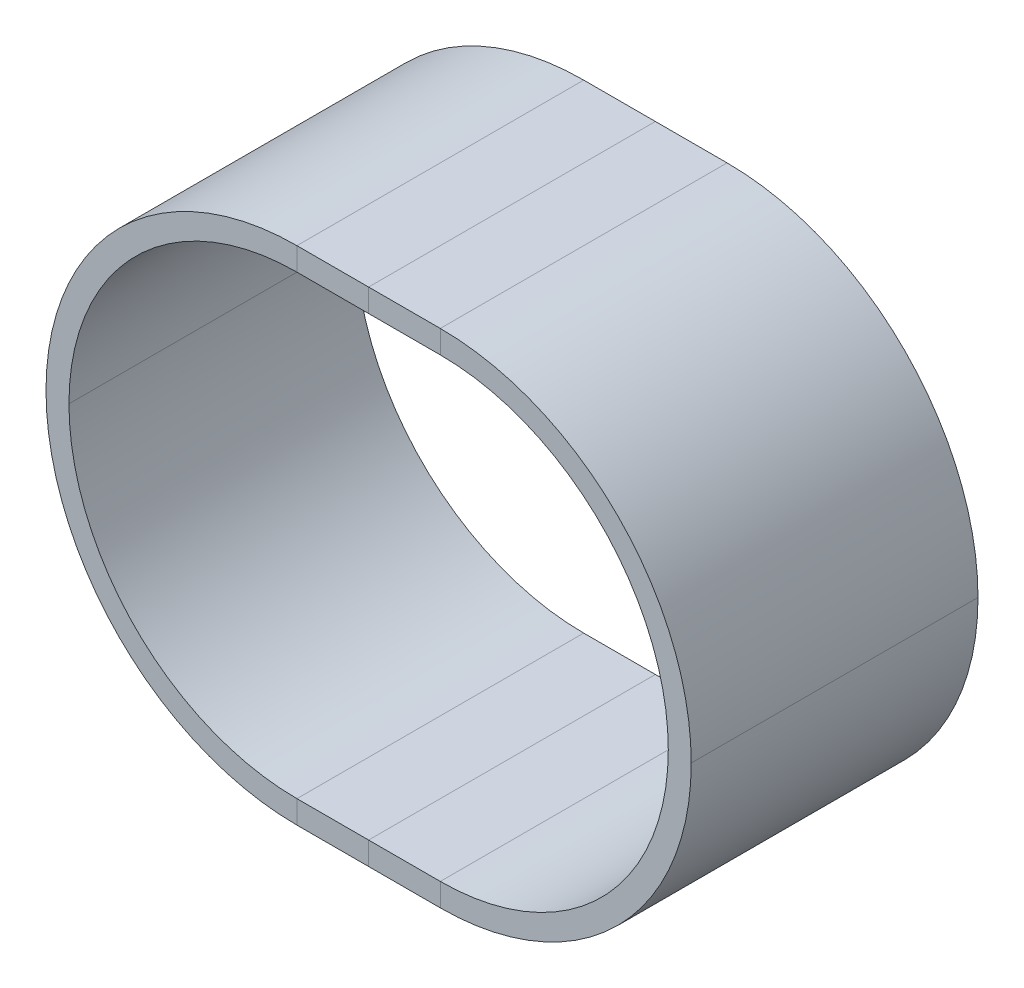
ISO-10303-21;
HEADER;
FILE_DESCRIPTION(('STEP AP214'),'2;1');
FILE_NAME('part.step','',(''),(''),'','','');
FILE_SCHEMA(('AUTOMOTIVE_DESIGN { 1 0 10303 214 1 1 1 1 }'));
ENDSEC;
DATA;
#1=APPLICATION_CONTEXT('core data for automotive mechanical design processes');
#2=APPLICATION_PROTOCOL_DEFINITION('international standard','automotive_design',2000,#1);
#3=PRODUCT_CONTEXT('',#1,'mechanical');
#4=PRODUCT('Part','Part','',(#3));
#5=PRODUCT_RELATED_PRODUCT_CATEGORY('part','',(#4));
#6=PRODUCT_DEFINITION_FORMATION('','',#4);
#7=PRODUCT_DEFINITION_CONTEXT('part definition',#1,'design');
#8=PRODUCT_DEFINITION('design','',#6,#7);
#9=PRODUCT_DEFINITION_SHAPE('','',#8);
#10=(LENGTH_UNIT() NAMED_UNIT(*) SI_UNIT(.MILLI.,.METRE.));
#11=(NAMED_UNIT(*) PLANE_ANGLE_UNIT() SI_UNIT($,.RADIAN.));
#12=(NAMED_UNIT(*) SI_UNIT($,.STERADIAN.) SOLID_ANGLE_UNIT());
#13=UNCERTAINTY_MEASURE_WITH_UNIT(LENGTH_MEASURE(1.E-05),#10,'distance_accuracy_value','');
#14=(GEOMETRIC_REPRESENTATION_CONTEXT(3) GLOBAL_UNCERTAINTY_ASSIGNED_CONTEXT((#13)) GLOBAL_UNIT_ASSIGNED_CONTEXT((#10,
#11,#12)) REPRESENTATION_CONTEXT('',''));
#15=CARTESIAN_POINT('',(0.,0.,0.));
#16=DIRECTION('',(0.,0.,1.));
#17=DIRECTION('',(1.,0.,0.));
#18=AXIS2_PLACEMENT_3D('',#15,#16,#17);
#19=CARTESIAN_POINT('',(-50.,1.11022302462516E-12,-100.));
#20=DIRECTION('',(0.,0.,-1.));
#21=DIRECTION('',(-1.,0.,0.));
#22=AXIS2_PLACEMENT_3D('',#19,#20,#21);
#23=PLANE('',#22);
#24=DIRECTION('',(1.,0.,0.));
#25=VECTOR('',#24,1.);
#26=CARTESIAN_POINT('',(-50.,159.,-100.));
#27=LINE('',#26,#25);
#28=CARTESIAN_POINT('',(-50.,159.,-100.));
#29=VERTEX_POINT('',#28);
#30=CARTESIAN_POINT('',(-3.91131611491869E-13,159.,-100.));
#31=VERTEX_POINT('',#30);
#32=EDGE_CURVE('P0_E219',#29,#31,#27,.T.);
#33=ORIENTED_EDGE('',*,*,#32,.F.);
#34=DIRECTION('',(0.,1.,0.));
#35=VECTOR('',#34,1.);
#36=CARTESIAN_POINT('',(-50.,159.,-100.));
#37=LINE('',#36,#35);
#38=CARTESIAN_POINT('',(-50.0000000000008,175.,-100.));
#39=VERTEX_POINT('',#38);
#40=EDGE_CURVE('P0_E181',#29,#39,#37,.T.);
#41=ORIENTED_EDGE('',*,*,#40,.T.);
#42=DIRECTION('',(1.,0.,0.));
#43=VECTOR('',#42,1.);
#44=CARTESIAN_POINT('',(-50.0000000000008,175.,-100.));
#45=LINE('',#44,#43);
#46=CARTESIAN_POINT('',(-3.85802503704219E-13,175.,-100.));
#47=VERTEX_POINT('',#46);
#48=EDGE_CURVE('P0_E161',#39,#47,#45,.T.);
#49=ORIENTED_EDGE('',*,*,#48,.T.);
#50=DIRECTION('',(0.,-1.,0.));
#51=VECTOR('',#50,1.);
#52=CARTESIAN_POINT('',(-3.85802503704219E-13,175.,-100.));
#53=LINE('',#52,#51);
#54=EDGE_CURVE('P0_E227',#47,#31,#53,.T.);
#55=ORIENTED_EDGE('',*,*,#54,.T.);
#56=EDGE_LOOP('',(#33,#41,#49,#55));
#57=FACE_BOUND('',#56,.T.);
#58=ADVANCED_FACE('P0_F17',(#57),#23,.T.);
#59=CARTESIAN_POINT('',(-50.,1.55431223447522E-12,100.));
#60=DIRECTION('',(0.,0.,-1.));
#61=DIRECTION('',(-1.,0.,0.));
#62=AXIS2_PLACEMENT_3D('',#59,#60,#61);
#63=PLANE('',#62);
#64=DIRECTION('',(-1.,0.,0.));
#65=VECTOR('',#64,1.);
#66=CARTESIAN_POINT('',(-50.,-159.,100.));
#67=LINE('',#66,#65);
#68=CARTESIAN_POINT('',(6.13176004658665E-13,-159.,100.));
#69=VERTEX_POINT('',#68);
#70=CARTESIAN_POINT('',(-50.,-159.,100.));
#71=VERTEX_POINT('',#70);
#72=EDGE_CURVE('P0_E11',#69,#71,#67,.T.);
#73=ORIENTED_EDGE('',*,*,#72,.T.);
#74=DIRECTION('',(0.,-1.,0.));
#75=VECTOR('',#74,1.);
#76=CARTESIAN_POINT('',(-50.,-159.,100.));
#77=LINE('',#76,#75);
#78=CARTESIAN_POINT('',(-50.,-175.,100.));
#79=VERTEX_POINT('',#78);
#80=EDGE_CURVE('P0_E99',#71,#79,#77,.T.);
#81=ORIENTED_EDGE('',*,*,#80,.T.);
#82=DIRECTION('',(-1.,0.,0.));
#83=VECTOR('',#82,1.);
#84=CARTESIAN_POINT('',(-50.,-175.,100.));
#85=LINE('',#84,#83);
#86=CARTESIAN_POINT('',(6.07846936575684E-13,-175.,99.9999999999987));
#87=VERTEX_POINT('',#86);
#88=EDGE_CURVE('P0_E164',#87,#79,#85,.T.);
#89=ORIENTED_EDGE('',*,*,#88,.F.);
#90=DIRECTION('',(0.,-1.,0.));
#91=VECTOR('',#90,1.);
#92=CARTESIAN_POINT('',(6.13176004658665E-13,-159.,100.));
#93=LINE('',#92,#91);
#94=EDGE_CURVE('P0_E101',#69,#87,#93,.T.);
#95=ORIENTED_EDGE('',*,*,#94,.F.);
#96=EDGE_LOOP('',(#73,#81,#89,#95));
#97=FACE_BOUND('',#96,.T.);
#98=ADVANCED_FACE('P0_F96',(#97),#63,.F.);
#99=CARTESIAN_POINT('',(-50.,1.55431223447522E-12,100.));
#100=DIRECTION('',(0.,0.,-1.));
#101=DIRECTION('',(-1.,0.,0.));
#102=AXIS2_PLACEMENT_3D('',#99,#100,#101);
#103=CYLINDRICAL_SURFACE('',#102,159.);
#104=DIRECTION('',(0.,0.,-1.));
#105=VECTOR('',#104,1.);
#106=CARTESIAN_POINT('',(-209.,2.05740979808411E-12,100.));
#107=LINE('',#106,#105);
#108=CARTESIAN_POINT('',(-209.,2.05740979808411E-12,100.));
#109=VERTEX_POINT('',#108);
#110=CARTESIAN_POINT('',(-209.,2.05740979808411E-12,-100.));
#111=VERTEX_POINT('',#110);
#112=EDGE_CURVE('P0_E120',#109,#111,#107,.T.);
#113=ORIENTED_EDGE('',*,*,#112,.F.);
#114=CARTESIAN_POINT('',(-50.,1.55431223447522E-12,100.));
#115=DIRECTION('',(0.,0.,-1.));
#116=DIRECTION('',(1.,0.,0.));
#117=AXIS2_PLACEMENT_3D('',#114,#115,#116);
#118=CIRCLE('',#117,159.);
#119=EDGE_CURVE('P0_E116',#71,#109,#118,.T.);
#120=ORIENTED_EDGE('',*,*,#119,.F.);
#121=DIRECTION('',(0.,0.,-1.));
#122=VECTOR('',#121,1.);
#123=CARTESIAN_POINT('',(-50.,-159.,100.));
#124=LINE('',#123,#122);
#125=CARTESIAN_POINT('',(-50.,-159.,-100.));
#126=VERTEX_POINT('',#125);
#127=EDGE_CURVE('P0_E28',#71,#126,#124,.T.);
#128=ORIENTED_EDGE('',*,*,#127,.T.);
#129=CARTESIAN_POINT('',(-50.,1.11022302462516E-12,-100.));
#130=DIRECTION('',(0.,0.,-1.));
#131=DIRECTION('',(1.,0.,0.));
#132=AXIS2_PLACEMENT_3D('',#129,#130,#131);
#133=CIRCLE('',#132,159.);
#134=EDGE_CURVE('P0_E184',#126,#111,#133,.T.);
#135=ORIENTED_EDGE('',*,*,#134,.T.);
#136=EDGE_LOOP('',(#113,#120,#128,#135));
#137=FACE_BOUND('',#136,.T.);
#138=ADVANCED_FACE('P0_F117',(#137),#103,.F.);
#139=CARTESIAN_POINT('',(-50.,-159.,100.));
#140=DIRECTION('',(0.,-1.,0.));
#141=DIRECTION('',(-1.,0.,0.));
#142=AXIS2_PLACEMENT_3D('',#139,#140,#141);
#143=PLANE('',#142);
#144=DIRECTION('',(-1.,0.,0.));
#145=VECTOR('',#144,1.);
#146=CARTESIAN_POINT('',(-50.,-159.,-100.));
#147=LINE('',#146,#145);
#148=CARTESIAN_POINT('',(3.91131399733633E-13,-159.,-100.));
#149=VERTEX_POINT('',#148);
#150=EDGE_CURVE('P0_E108',#149,#126,#147,.T.);
#151=ORIENTED_EDGE('',*,*,#150,.T.);
#152=ORIENTED_EDGE('',*,*,#127,.F.);
#153=ORIENTED_EDGE('',*,*,#72,.F.);
#154=DIRECTION('',(0.,0.,-1.));
#155=VECTOR('',#154,1.);
#156=CARTESIAN_POINT('',(6.13176004658665E-13,-159.,100.));
#157=LINE('',#156,#155);
#158=EDGE_CURVE('P0_E162',#69,#149,#157,.T.);
#159=ORIENTED_EDGE('',*,*,#158,.T.);
#160=EDGE_LOOP('',(#151,#152,#153,#159));
#161=FACE_BOUND('',#160,.T.);
#162=ADVANCED_FACE('P0_F106',(#161),#143,.F.);
#163=CARTESIAN_POINT('',(6.13176004658665E-13,-159.,100.));
#164=DIRECTION('',(1.,0.,0.));
#165=DIRECTION('',(0.,1.,0.));
#166=AXIS2_PLACEMENT_3D('',#163,#164,#165);
#167=PLANE('',#166);
#168=DIRECTION('',(0.,-1.,0.));
#169=VECTOR('',#168,1.);
#170=CARTESIAN_POINT('',(3.91131399733633E-13,-159.,-100.));
#171=LINE('',#170,#169);
#172=CARTESIAN_POINT('',(6.07846936575684E-13,-175.,-100.));
#173=VERTEX_POINT('',#172);
#174=EDGE_CURVE('P0_E197',#149,#173,#171,.T.);
#175=ORIENTED_EDGE('',*,*,#174,.F.);
#176=ORIENTED_EDGE('',*,*,#158,.F.);
#177=ORIENTED_EDGE('',*,*,#94,.T.);
#178=DIRECTION('',(0.,0.,-1.));
#179=VECTOR('',#178,1.);
#180=CARTESIAN_POINT('',(6.07846936575684E-13,-175.,99.9999999999987));
#181=LINE('',#180,#179);
#182=EDGE_CURVE('P0_E160',#87,#173,#181,.T.);
#183=ORIENTED_EDGE('',*,*,#182,.T.);
#184=EDGE_LOOP('',(#175,#176,#177,#183));
#185=FACE_BOUND('',#184,.T.);
#186=ADVANCED_FACE('P0_F388',(#185),#167,.T.);
#187=CARTESIAN_POINT('',(-50.,-175.,100.));
#188=DIRECTION('',(0.,-1.,0.));
#189=DIRECTION('',(-1.,0.,0.));
#190=AXIS2_PLACEMENT_3D('',#187,#188,#189);
#191=PLANE('',#190);
#192=DIRECTION('',(-1.,0.,0.));
#193=VECTOR('',#192,1.);
#194=CARTESIAN_POINT('',(-49.9999999999991,-175.,-100.));
#195=LINE('',#194,#193);
#196=CARTESIAN_POINT('',(-49.9999999999991,-175.,-100.));
#197=VERTEX_POINT('',#196);
#198=EDGE_CURVE('P0_E198',#173,#197,#195,.T.);
#199=ORIENTED_EDGE('',*,*,#198,.F.);
#200=ORIENTED_EDGE('',*,*,#182,.F.);
#201=ORIENTED_EDGE('',*,*,#88,.T.);
#202=DIRECTION('',(0.,0.,-1.));
#203=VECTOR('',#202,1.);
#204=CARTESIAN_POINT('',(-50.,-175.,100.));
#205=LINE('',#204,#203);
#206=EDGE_CURVE('P0_E210',#79,#197,#205,.T.);
#207=ORIENTED_EDGE('',*,*,#206,.T.);
#208=EDGE_LOOP('',(#199,#200,#201,#207));
#209=FACE_BOUND('',#208,.T.);
#210=ADVANCED_FACE('P0_F247',(#209),#191,.T.);
#211=CARTESIAN_POINT('',(-50.,1.55431223447522E-12,100.));
#212=DIRECTION('',(0.,0.,-1.));
#213=DIRECTION('',(-1.,0.,0.));
#214=AXIS2_PLACEMENT_3D('',#211,#212,#213);
#215=CYLINDRICAL_SURFACE('',#214,175.);
#216=DIRECTION('',(0.,0.,-1.));
#217=VECTOR('',#216,1.);
#218=CARTESIAN_POINT('',(-225.,2.10803596800701E-12,100.));
#219=LINE('',#218,#217);
#220=CARTESIAN_POINT('',(-225.,2.10803596800701E-12,100.));
#221=VERTEX_POINT('',#220);
#222=CARTESIAN_POINT('',(-225.,2.10803596800701E-12,-100.));
#223=VERTEX_POINT('',#222);
#224=EDGE_CURVE('P0_E151',#221,#223,#219,.T.);
#225=ORIENTED_EDGE('',*,*,#224,.F.);
#226=CARTESIAN_POINT('',(-50.,1.55431223447522E-12,100.));
#227=DIRECTION('',(0.,0.,-1.));
#228=DIRECTION('',(1.,0.,0.));
#229=AXIS2_PLACEMENT_3D('',#226,#227,#228);
#230=CIRCLE('',#229,175.);
#231=CARTESIAN_POINT('',(-50.0000000000008,175.,100.));
#232=VERTEX_POINT('',#231);
#233=EDGE_CURVE('P0_E134',#221,#232,#230,.T.);
#234=ORIENTED_EDGE('',*,*,#233,.T.);
#235=DIRECTION('',(0.,0.,-1.));
#236=VECTOR('',#235,1.);
#237=CARTESIAN_POINT('',(-50.0000000000008,175.,100.));
#238=LINE('',#237,#236);
#239=EDGE_CURVE('P0_E156',#232,#39,#238,.T.);
#240=ORIENTED_EDGE('',*,*,#239,.T.);
#241=CARTESIAN_POINT('',(-50.,1.11022302462516E-12,-100.));
#242=DIRECTION('',(0.,0.,-1.));
#243=DIRECTION('',(1.,0.,0.));
#244=AXIS2_PLACEMENT_3D('',#241,#242,#243);
#245=CIRCLE('',#244,175.);
#246=EDGE_CURVE('P0_E185',#223,#39,#245,.T.);
#247=ORIENTED_EDGE('',*,*,#246,.F.);
#248=EDGE_LOOP('',(#225,#234,#240,#247));
#249=FACE_BOUND('',#248,.T.);
#250=ADVANCED_FACE('P0_F349',(#249),#215,.T.);
#251=CARTESIAN_POINT('',(-50.0000000000008,175.,100.));
#252=DIRECTION('',(0.,1.,0.));
#253=DIRECTION('',(1.,0.,0.));
#254=AXIS2_PLACEMENT_3D('',#251,#252,#253);
#255=PLANE('',#254);
#256=ORIENTED_EDGE('',*,*,#48,.F.);
#257=ORIENTED_EDGE('',*,*,#239,.F.);
#258=DIRECTION('',(1.,0.,0.));
#259=VECTOR('',#258,1.);
#260=CARTESIAN_POINT('',(-50.0000000000008,175.,100.));
#261=LINE('',#260,#259);
#262=CARTESIAN_POINT('',(-3.8580250370422E-13,175.,100.));
#263=VERTEX_POINT('',#262);
#264=EDGE_CURVE('P0_E125',#232,#263,#261,.T.);
#265=ORIENTED_EDGE('',*,*,#264,.T.);
#266=DIRECTION('',(0.,0.,-1.));
#267=VECTOR('',#266,1.);
#268=CARTESIAN_POINT('',(-3.8580250370422E-13,175.,100.));
#269=LINE('',#268,#267);
#270=EDGE_CURVE('P0_E85',#263,#47,#269,.T.);
#271=ORIENTED_EDGE('',*,*,#270,.T.);
#272=EDGE_LOOP('',(#256,#257,#265,#271));
#273=FACE_BOUND('',#272,.T.);
#274=ADVANCED_FACE('P0_F354',(#273),#255,.T.);
#275=CARTESIAN_POINT('',(-3.8580250370422E-13,175.,100.));
#276=DIRECTION('',(1.,0.,0.));
#277=DIRECTION('',(0.,1.,0.));
#278=AXIS2_PLACEMENT_3D('',#275,#276,#277);
#279=PLANE('',#278);
#280=ORIENTED_EDGE('',*,*,#54,.F.);
#281=ORIENTED_EDGE('',*,*,#270,.F.);
#282=DIRECTION('',(0.,-1.,0.));
#283=VECTOR('',#282,1.);
#284=CARTESIAN_POINT('',(-3.8580250370422E-13,175.,100.));
#285=LINE('',#284,#283);
#286=CARTESIAN_POINT('',(-3.9113161149187E-13,159.,100.));
#287=VERTEX_POINT('',#286);
#288=EDGE_CURVE('P0_E150',#263,#287,#285,.T.);
#289=ORIENTED_EDGE('',*,*,#288,.T.);
#290=DIRECTION('',(0.,0.,-1.));
#291=VECTOR('',#290,1.);
#292=CARTESIAN_POINT('',(-3.9113161149187E-13,159.,100.));
#293=LINE('',#292,#291);
#294=EDGE_CURVE('P0_E223',#287,#31,#293,.T.);
#295=ORIENTED_EDGE('',*,*,#294,.T.);
#296=EDGE_LOOP('',(#280,#281,#289,#295));
#297=FACE_BOUND('',#296,.T.);
#298=ADVANCED_FACE('P0_F362',(#297),#279,.T.);
#299=CARTESIAN_POINT('',(-50.0000000000007,159.,100.));
#300=DIRECTION('',(0.,1.,0.));
#301=DIRECTION('',(1.,0.,0.));
#302=AXIS2_PLACEMENT_3D('',#299,#300,#301);
#303=PLANE('',#302);
#304=ORIENTED_EDGE('',*,*,#32,.T.);
#305=ORIENTED_EDGE('',*,*,#294,.F.);
#306=DIRECTION('',(1.,0.,0.));
#307=VECTOR('',#306,1.);
#308=CARTESIAN_POINT('',(-50.0000000000007,159.,100.));
#309=LINE('',#308,#307);
#310=CARTESIAN_POINT('',(-50.0000000000007,159.,100.));
#311=VERTEX_POINT('',#310);
#312=EDGE_CURVE('P0_E147',#311,#287,#309,.T.);
#313=ORIENTED_EDGE('',*,*,#312,.F.);
#314=DIRECTION('',(0.,0.,-1.));
#315=VECTOR('',#314,1.);
#316=CARTESIAN_POINT('',(-50.0000000000007,159.,100.));
#317=LINE('',#316,#315);
#318=EDGE_CURVE('P0_E190',#311,#29,#317,.T.);
#319=ORIENTED_EDGE('',*,*,#318,.T.);
#320=EDGE_LOOP('',(#304,#305,#313,#319));
#321=FACE_BOUND('',#320,.T.);
#322=ADVANCED_FACE('P0_F367',(#321),#303,.F.);
#323=CARTESIAN_POINT('',(-50.,159.,-100.));
#324=DIRECTION('',(0.,0.,-1.));
#325=DIRECTION('',(-1.,0.,0.));
#326=AXIS2_PLACEMENT_3D('',#323,#324,#325);
#327=PLANE('',#326);
#328=ORIENTED_EDGE('',*,*,#198,.T.);
#329=DIRECTION('',(0.,1.,0.));
#330=VECTOR('',#329,1.);
#331=CARTESIAN_POINT('',(-49.9999999999991,-175.,-100.));
#332=LINE('',#331,#330);
#333=EDGE_CURVE('P0_E203',#197,#126,#332,.T.);
#334=ORIENTED_EDGE('',*,*,#333,.T.);
#335=ORIENTED_EDGE('',*,*,#150,.F.);
#336=ORIENTED_EDGE('',*,*,#174,.T.);
#337=EDGE_LOOP('',(#328,#334,#335,#336));
#338=FACE_BOUND('',#337,.T.);
#339=ADVANCED_FACE('P0_F433',(#338),#327,.T.);
#340=CARTESIAN_POINT('',(-49.9999999999991,-175.,-100.));
#341=DIRECTION('',(0.,0.,-1.));
#342=DIRECTION('',(-1.,0.,0.));
#343=AXIS2_PLACEMENT_3D('',#340,#341,#342);
#344=PLANE('',#343);
#345=ORIENTED_EDGE('',*,*,#333,.F.);
#346=CARTESIAN_POINT('',(-50.,1.11022302462516E-12,-100.));
#347=DIRECTION('',(0.,0.,-1.));
#348=DIRECTION('',(1.,0.,0.));
#349=AXIS2_PLACEMENT_3D('',#346,#347,#348);
#350=CIRCLE('',#349,175.);
#351=EDGE_CURVE('P0_E155',#197,#223,#350,.T.);
#352=ORIENTED_EDGE('',*,*,#351,.T.);
#353=ORIENTED_EDGE('',*,*,#246,.T.);
#354=ORIENTED_EDGE('',*,*,#40,.F.);
#355=CARTESIAN_POINT('',(-50.,1.11022302462516E-12,-100.));
#356=DIRECTION('',(0.,0.,-1.));
#357=DIRECTION('',(1.,0.,0.));
#358=AXIS2_PLACEMENT_3D('',#355,#356,#357);
#359=CIRCLE('',#358,159.);
#360=EDGE_CURVE('P0_E186',#111,#29,#359,.T.);
#361=ORIENTED_EDGE('',*,*,#360,.F.);
#362=ORIENTED_EDGE('',*,*,#134,.F.);
#363=EDGE_LOOP('',(#345,#352,#353,#354,#361,#362));
#364=FACE_BOUND('',#363,.T.);
#365=ADVANCED_FACE('P0_F254',(#364),#344,.T.);
#366=CARTESIAN_POINT('',(-50.,-159.,100.));
#367=DIRECTION('',(0.,0.,1.));
#368=DIRECTION('',(0.,-1.,0.));
#369=AXIS2_PLACEMENT_3D('',#366,#367,#368);
#370=PLANE('',#369);
#371=ORIENTED_EDGE('',*,*,#264,.F.);
#372=DIRECTION('',(0.,-1.,0.));
#373=VECTOR('',#372,1.);
#374=CARTESIAN_POINT('',(-50.0000000000008,175.,100.));
#375=LINE('',#374,#373);
#376=EDGE_CURVE('P0_E142',#232,#311,#375,.T.);
#377=ORIENTED_EDGE('',*,*,#376,.T.);
#378=ORIENTED_EDGE('',*,*,#312,.T.);
#379=ORIENTED_EDGE('',*,*,#288,.F.);
#380=EDGE_LOOP('',(#371,#377,#378,#379));
#381=FACE_BOUND('',#380,.T.);
#382=ADVANCED_FACE('P0_F19',(#381),#370,.T.);
#383=CARTESIAN_POINT('',(-50.0000000000008,175.,100.));
#384=DIRECTION('',(0.,0.,1.));
#385=DIRECTION('',(0.,-1.,0.));
#386=AXIS2_PLACEMENT_3D('',#383,#384,#385);
#387=PLANE('',#386);
#388=ORIENTED_EDGE('',*,*,#376,.F.);
#389=ORIENTED_EDGE('',*,*,#233,.F.);
#390=CARTESIAN_POINT('',(-50.,1.55431223447522E-12,100.));
#391=DIRECTION('',(0.,0.,-1.));
#392=DIRECTION('',(1.,0.,0.));
#393=AXIS2_PLACEMENT_3D('',#390,#391,#392);
#394=CIRCLE('',#393,175.);
#395=EDGE_CURVE('P0_E132',#79,#221,#394,.T.);
#396=ORIENTED_EDGE('',*,*,#395,.F.);
#397=ORIENTED_EDGE('',*,*,#80,.F.);
#398=ORIENTED_EDGE('',*,*,#119,.T.);
#399=CARTESIAN_POINT('',(-50.,1.55431223447522E-12,100.));
#400=DIRECTION('',(0.,0.,-1.));
#401=DIRECTION('',(1.,0.,0.));
#402=AXIS2_PLACEMENT_3D('',#399,#400,#401);
#403=CIRCLE('',#402,159.);
#404=EDGE_CURVE('P0_E21',#109,#311,#403,.T.);
#405=ORIENTED_EDGE('',*,*,#404,.T.);
#406=EDGE_LOOP('',(#388,#389,#396,#397,#398,#405));
#407=FACE_BOUND('',#406,.T.);
#408=ADVANCED_FACE('P0_F129',(#407),#387,.T.);
#409=CARTESIAN_POINT('',(-50.,1.55431223447522E-12,100.));
#410=DIRECTION('',(0.,0.,-1.));
#411=DIRECTION('',(-1.,0.,0.));
#412=AXIS2_PLACEMENT_3D('',#409,#410,#411);
#413=CYLINDRICAL_SURFACE('',#412,175.);
#414=ORIENTED_EDGE('',*,*,#395,.T.);
#415=ORIENTED_EDGE('',*,*,#224,.T.);
#416=ORIENTED_EDGE('',*,*,#351,.F.);
#417=ORIENTED_EDGE('',*,*,#206,.F.);
#418=EDGE_LOOP('',(#414,#415,#416,#417));
#419=FACE_BOUND('',#418,.T.);
#420=ADVANCED_FACE('P0_F250',(#419),#413,.T.);
#421=CARTESIAN_POINT('',(-50.,1.55431223447522E-12,100.));
#422=DIRECTION('',(0.,0.,-1.));
#423=DIRECTION('',(-1.,0.,0.));
#424=AXIS2_PLACEMENT_3D('',#421,#422,#423);
#425=CYLINDRICAL_SURFACE('',#424,159.);
#426=ORIENTED_EDGE('',*,*,#404,.F.);
#427=ORIENTED_EDGE('',*,*,#112,.T.);
#428=ORIENTED_EDGE('',*,*,#360,.T.);
#429=ORIENTED_EDGE('',*,*,#318,.F.);
#430=EDGE_LOOP('',(#426,#427,#428,#429));
#431=FACE_BOUND('',#430,.T.);
#432=ADVANCED_FACE('P0_F410',(#431),#425,.F.);
#433=CLOSED_SHELL('',(#58,#98,#138,#162,#186,#210,#250,#274,#298,#322,#339,#365,#382,#408,#420,#432));
#434=MANIFOLD_SOLID_BREP('P0_B1',#433);
#435=CARTESIAN_POINT('',(50.,-8.32667268468867E-13,100.));
#436=DIRECTION('',(0.,0.,1.));
#437=DIRECTION('',(1.,0.,0.));
#438=AXIS2_PLACEMENT_3D('',#435,#436,#437);
#439=PLANE('',#438);
#440=DIRECTION('',(-1.,0.,0.));
#441=VECTOR('',#440,1.);
#442=CARTESIAN_POINT('',(50.,159.,99.9999999999987));
#443=LINE('',#442,#441);
#444=CARTESIAN_POINT('',(50.,159.,99.9999999999987));
#445=VERTEX_POINT('',#444);
#446=CARTESIAN_POINT('',(-3.9113161149187E-13,159.,100.));
#447=VERTEX_POINT('',#446);
#448=EDGE_CURVE('P1_E184',#445,#447,#443,.T.);
#449=ORIENTED_EDGE('',*,*,#448,.F.);
#450=DIRECTION('',(0.,1.,0.));
#451=VECTOR('',#450,1.);
#452=CARTESIAN_POINT('',(50.,159.,99.9999999999987));
#453=LINE('',#452,#451);
#454=CARTESIAN_POINT('',(50.,175.,99.9999999999989));
#455=VERTEX_POINT('',#454);
#456=EDGE_CURVE('P1_E129',#445,#455,#453,.T.);
#457=ORIENTED_EDGE('',*,*,#456,.T.);
#458=DIRECTION('',(-1.,0.,0.));
#459=VECTOR('',#458,1.);
#460=CARTESIAN_POINT('',(50.,175.,99.9999999999989));
#461=LINE('',#460,#459);
#462=CARTESIAN_POINT('',(-3.8580250370422E-13,175.,100.));
#463=VERTEX_POINT('',#462);
#464=EDGE_CURVE('P1_E170',#455,#463,#461,.T.);
#465=ORIENTED_EDGE('',*,*,#464,.T.);
#466=DIRECTION('',(0.,-1.,0.));
#467=VECTOR('',#466,1.);
#468=CARTESIAN_POINT('',(-3.8580250370422E-13,175.,100.));
#469=LINE('',#468,#467);
#470=EDGE_CURVE('P1_E171',#463,#447,#469,.T.);
#471=ORIENTED_EDGE('',*,*,#470,.T.);
#472=EDGE_LOOP('',(#449,#457,#465,#471));
#473=FACE_BOUND('',#472,.T.);
#474=ADVANCED_FACE('P1_F17',(#473),#439,.T.);
#475=CARTESIAN_POINT('',(50.,2.22044604925032E-13,-100.));
#476=DIRECTION('',(0.,0.,1.));
#477=DIRECTION('',(1.,0.,0.));
#478=AXIS2_PLACEMENT_3D('',#475,#476,#477);
#479=PLANE('',#478);
#480=DIRECTION('',(1.,0.,0.));
#481=VECTOR('',#480,1.);
#482=CARTESIAN_POINT('',(50.,-159.,-100.));
#483=LINE('',#482,#481);
#484=CARTESIAN_POINT('',(3.91131399733633E-13,-159.,-100.));
#485=VERTEX_POINT('',#484);
#486=CARTESIAN_POINT('',(50.,-159.,-100.));
#487=VERTEX_POINT('',#486);
#488=EDGE_CURVE('P1_E11',#485,#487,#483,.T.);
#489=ORIENTED_EDGE('',*,*,#488,.T.);
#490=DIRECTION('',(0.,-1.,0.));
#491=VECTOR('',#490,1.);
#492=CARTESIAN_POINT('',(50.,-159.,-100.));
#493=LINE('',#492,#491);
#494=CARTESIAN_POINT('',(50.,-175.,-100.));
#495=VERTEX_POINT('',#494);
#496=EDGE_CURVE('P1_E175',#487,#495,#493,.T.);
#497=ORIENTED_EDGE('',*,*,#496,.T.);
#498=DIRECTION('',(1.,0.,0.));
#499=VECTOR('',#498,1.);
#500=CARTESIAN_POINT('',(50.,-175.,-100.));
#501=LINE('',#500,#499);
#502=CARTESIAN_POINT('',(3.85802331650653E-13,-175.,-100.));
#503=VERTEX_POINT('',#502);
#504=EDGE_CURVE('P1_E163',#503,#495,#501,.T.);
#505=ORIENTED_EDGE('',*,*,#504,.F.);
#506=DIRECTION('',(0.,-1.,0.));
#507=VECTOR('',#506,1.);
#508=CARTESIAN_POINT('',(3.91131399733633E-13,-159.,-100.));
#509=LINE('',#508,#507);
#510=EDGE_CURVE('P1_E20',#485,#503,#509,.T.);
#511=ORIENTED_EDGE('',*,*,#510,.F.);
#512=EDGE_LOOP('',(#489,#497,#505,#511));
#513=FACE_BOUND('',#512,.T.);
#514=ADVANCED_FACE('P1_F351',(#513),#479,.F.);
#515=CARTESIAN_POINT('',(50.,2.22044604925032E-13,-100.));
#516=DIRECTION('',(0.,0.,1.));
#517=DIRECTION('',(1.,0.,0.));
#518=AXIS2_PLACEMENT_3D('',#515,#516,#517);
#519=CYLINDRICAL_SURFACE('',#518,159.);
#520=DIRECTION('',(0.,0.,1.));
#521=VECTOR('',#520,1.);
#522=CARTESIAN_POINT('',(209.,-4.98281557078448E-13,-100.));
#523=LINE('',#522,#521);
#524=CARTESIAN_POINT('',(209.,-4.95505999516887E-13,-100.));
#525=VERTEX_POINT('',#524);
#526=CARTESIAN_POINT('',(209.,-4.95505999516885E-13,100.));
#527=VERTEX_POINT('',#526);
#528=EDGE_CURVE('P1_E216',#525,#527,#523,.T.);
#529=ORIENTED_EDGE('',*,*,#528,.F.);
#530=CARTESIAN_POINT('',(50.,2.22044604925032E-13,-100.));
#531=DIRECTION('',(0.,0.,1.));
#532=DIRECTION('',(-1.,0.,0.));
#533=AXIS2_PLACEMENT_3D('',#530,#531,#532);
#534=CIRCLE('',#533,159.);
#535=EDGE_CURVE('P1_E177',#487,#525,#534,.T.);
#536=ORIENTED_EDGE('',*,*,#535,.F.);
#537=DIRECTION('',(0.,0.,1.));
#538=VECTOR('',#537,1.);
#539=CARTESIAN_POINT('',(50.,-159.,-100.));
#540=LINE('',#539,#538);
#541=CARTESIAN_POINT('',(50.,-159.,100.));
#542=VERTEX_POINT('',#541);
#543=EDGE_CURVE('P1_E27',#487,#542,#540,.T.);
#544=ORIENTED_EDGE('',*,*,#543,.T.);
#545=CARTESIAN_POINT('',(50.,-8.32667268468867E-13,100.));
#546=DIRECTION('',(0.,0.,1.));
#547=DIRECTION('',(-1.,0.,0.));
#548=AXIS2_PLACEMENT_3D('',#545,#546,#547);
#549=CIRCLE('',#548,159.);
#550=EDGE_CURVE('P1_E159',#542,#527,#549,.T.);
#551=ORIENTED_EDGE('',*,*,#550,.T.);
#552=EDGE_LOOP('',(#529,#536,#544,#551));
#553=FACE_BOUND('',#552,.T.);
#554=ADVANCED_FACE('P1_F416',(#553),#519,.F.);
#555=CARTESIAN_POINT('',(50.,-159.,-100.));
#556=DIRECTION('',(0.,-1.,0.));
#557=DIRECTION('',(-1.,0.,0.));
#558=AXIS2_PLACEMENT_3D('',#555,#556,#557);
#559=PLANE('',#558);
#560=DIRECTION('',(1.,0.,0.));
#561=VECTOR('',#560,1.);
#562=CARTESIAN_POINT('',(50.,-159.,100.));
#563=LINE('',#562,#561);
#564=CARTESIAN_POINT('',(3.91131399733633E-13,-159.,100.));
#565=VERTEX_POINT('',#564);
#566=EDGE_CURVE('P1_E158',#565,#542,#563,.T.);
#567=ORIENTED_EDGE('',*,*,#566,.T.);
#568=ORIENTED_EDGE('',*,*,#543,.F.);
#569=ORIENTED_EDGE('',*,*,#488,.F.);
#570=DIRECTION('',(0.,0.,1.));
#571=VECTOR('',#570,1.);
#572=CARTESIAN_POINT('',(3.91131399733633E-13,-159.,-100.));
#573=LINE('',#572,#571);
#574=EDGE_CURVE('P1_E195',#485,#565,#573,.T.);
#575=ORIENTED_EDGE('',*,*,#574,.T.);
#576=EDGE_LOOP('',(#567,#568,#569,#575));
#577=FACE_BOUND('',#576,.T.);
#578=ADVANCED_FACE('P1_F366',(#577),#559,.F.);
#579=CARTESIAN_POINT('',(3.91131399733633E-13,-159.,-100.));
#580=DIRECTION('',(-1.,0.,0.));
#581=DIRECTION('',(0.,1.,0.));
#582=AXIS2_PLACEMENT_3D('',#579,#580,#581);
#583=PLANE('',#582);
#584=DIRECTION('',(0.,-1.,0.));
#585=VECTOR('',#584,1.);
#586=CARTESIAN_POINT('',(3.91131399733633E-13,-159.,100.));
#587=LINE('',#586,#585);
#588=CARTESIAN_POINT('',(3.85802331650654E-13,-175.,99.9999999999987));
#589=VERTEX_POINT('',#588);
#590=EDGE_CURVE('P1_E181',#565,#589,#587,.T.);
#591=ORIENTED_EDGE('',*,*,#590,.F.);
#592=ORIENTED_EDGE('',*,*,#574,.F.);
#593=ORIENTED_EDGE('',*,*,#510,.T.);
#594=DIRECTION('',(0.,0.,1.));
#595=VECTOR('',#594,1.);
#596=CARTESIAN_POINT('',(3.85802331650653E-13,-175.,-100.));
#597=LINE('',#596,#595);
#598=EDGE_CURVE('P1_E160',#503,#589,#597,.T.);
#599=ORIENTED_EDGE('',*,*,#598,.T.);
#600=EDGE_LOOP('',(#591,#592,#593,#599));
#601=FACE_BOUND('',#600,.T.);
#602=ADVANCED_FACE('P1_F361',(#601),#583,.T.);
#603=CARTESIAN_POINT('',(50.,-175.,-100.));
#604=DIRECTION('',(0.,-1.,0.));
#605=DIRECTION('',(-1.,0.,0.));
#606=AXIS2_PLACEMENT_3D('',#603,#604,#605);
#607=PLANE('',#606);
#608=DIRECTION('',(1.,0.,0.));
#609=VECTOR('',#608,1.);
#610=CARTESIAN_POINT('',(50.,-175.,99.9999999999981));
#611=LINE('',#610,#609);
#612=CARTESIAN_POINT('',(50.,-175.,99.9999999999981));
#613=VERTEX_POINT('',#612);
#614=EDGE_CURVE('P1_E107',#589,#613,#611,.T.);
#615=ORIENTED_EDGE('',*,*,#614,.F.);
#616=ORIENTED_EDGE('',*,*,#598,.F.);
#617=ORIENTED_EDGE('',*,*,#504,.T.);
#618=DIRECTION('',(0.,0.,1.));
#619=VECTOR('',#618,1.);
#620=CARTESIAN_POINT('',(50.,-175.,-100.));
#621=LINE('',#620,#619);
#622=EDGE_CURVE('P1_E140',#495,#613,#621,.T.);
#623=ORIENTED_EDGE('',*,*,#622,.T.);
#624=EDGE_LOOP('',(#615,#616,#617,#623));
#625=FACE_BOUND('',#624,.T.);
#626=ADVANCED_FACE('P1_F365',(#625),#607,.T.);
#627=CARTESIAN_POINT('',(50.,2.22044604925032E-13,-100.));
#628=DIRECTION('',(0.,0.,1.));
#629=DIRECTION('',(1.,0.,0.));
#630=AXIS2_PLACEMENT_3D('',#627,#628,#629);
#631=CYLINDRICAL_SURFACE('',#630,175.);
#632=DIRECTION('',(0.,0.,1.));
#633=VECTOR('',#632,1.);
#634=CARTESIAN_POINT('',(225.,-5.7076720860081E-13,-100.));
#635=LINE('',#634,#633);
#636=CARTESIAN_POINT('',(225.,-5.67991651039249E-13,-100.));
#637=VERTEX_POINT('',#636);
#638=CARTESIAN_POINT('',(225.,-5.67991651039248E-13,100.));
#639=VERTEX_POINT('',#638);
#640=EDGE_CURVE('P1_E122',#637,#639,#635,.T.);
#641=ORIENTED_EDGE('',*,*,#640,.F.);
#642=CARTESIAN_POINT('',(50.,2.22044604925032E-13,-100.));
#643=DIRECTION('',(0.,0.,1.));
#644=DIRECTION('',(-1.,0.,0.));
#645=AXIS2_PLACEMENT_3D('',#642,#643,#644);
#646=CIRCLE('',#645,175.);
#647=CARTESIAN_POINT('',(50.,175.,-100.));
#648=VERTEX_POINT('',#647);
#649=EDGE_CURVE('P1_E172',#637,#648,#646,.T.);
#650=ORIENTED_EDGE('',*,*,#649,.T.);
#651=DIRECTION('',(0.,0.,1.));
#652=VECTOR('',#651,1.);
#653=CARTESIAN_POINT('',(50.,175.,-100.));
#654=LINE('',#653,#652);
#655=EDGE_CURVE('P1_E124',#648,#455,#654,.T.);
#656=ORIENTED_EDGE('',*,*,#655,.T.);
#657=CARTESIAN_POINT('',(50.,-8.32667268468867E-13,100.));
#658=DIRECTION('',(0.,0.,1.));
#659=DIRECTION('',(-1.,0.,0.));
#660=AXIS2_PLACEMENT_3D('',#657,#658,#659);
#661=CIRCLE('',#660,175.);
#662=EDGE_CURVE('P1_E117',#639,#455,#661,.T.);
#663=ORIENTED_EDGE('',*,*,#662,.F.);
#664=EDGE_LOOP('',(#641,#650,#656,#663));
#665=FACE_BOUND('',#664,.T.);
#666=ADVANCED_FACE('P1_F119',(#665),#631,.T.);
#667=CARTESIAN_POINT('',(50.,175.,-100.));
#668=DIRECTION('',(0.,1.,0.));
#669=DIRECTION('',(1.,0.,0.));
#670=AXIS2_PLACEMENT_3D('',#667,#668,#669);
#671=PLANE('',#670);
#672=ORIENTED_EDGE('',*,*,#464,.F.);
#673=ORIENTED_EDGE('',*,*,#655,.F.);
#674=DIRECTION('',(-1.,0.,0.));
#675=VECTOR('',#674,1.);
#676=CARTESIAN_POINT('',(50.,175.,-100.));
#677=LINE('',#676,#675);
#678=CARTESIAN_POINT('',(-3.85802503704219E-13,175.,-100.));
#679=VERTEX_POINT('',#678);
#680=EDGE_CURVE('P1_E180',#648,#679,#677,.T.);
#681=ORIENTED_EDGE('',*,*,#680,.T.);
#682=DIRECTION('',(0.,0.,1.));
#683=VECTOR('',#682,1.);
#684=CARTESIAN_POINT('',(-3.85802503704219E-13,175.,-100.));
#685=LINE('',#684,#683);
#686=EDGE_CURVE('P1_E166',#679,#463,#685,.T.);
#687=ORIENTED_EDGE('',*,*,#686,.T.);
#688=EDGE_LOOP('',(#672,#673,#681,#687));
#689=FACE_BOUND('',#688,.T.);
#690=ADVANCED_FACE('P1_F261',(#689),#671,.T.);
#691=CARTESIAN_POINT('',(-3.85802503704219E-13,175.,-100.));
#692=DIRECTION('',(-1.,0.,0.));
#693=DIRECTION('',(0.,1.,0.));
#694=AXIS2_PLACEMENT_3D('',#691,#692,#693);
#695=PLANE('',#694);
#696=ORIENTED_EDGE('',*,*,#470,.F.);
#697=ORIENTED_EDGE('',*,*,#686,.F.);
#698=DIRECTION('',(0.,-1.,0.));
#699=VECTOR('',#698,1.);
#700=CARTESIAN_POINT('',(-3.85802503704219E-13,175.,-100.));
#701=LINE('',#700,#699);
#702=CARTESIAN_POINT('',(-3.91131611491869E-13,159.,-100.));
#703=VERTEX_POINT('',#702);
#704=EDGE_CURVE('P1_E187',#679,#703,#701,.T.);
#705=ORIENTED_EDGE('',*,*,#704,.T.);
#706=DIRECTION('',(0.,0.,1.));
#707=VECTOR('',#706,1.);
#708=CARTESIAN_POINT('',(-3.91131611491869E-13,159.,-100.));
#709=LINE('',#708,#707);
#710=EDGE_CURVE('P1_E214',#703,#447,#709,.T.);
#711=ORIENTED_EDGE('',*,*,#710,.T.);
#712=EDGE_LOOP('',(#696,#697,#705,#711));
#713=FACE_BOUND('',#712,.T.);
#714=ADVANCED_FACE('P1_F379',(#713),#695,.T.);
#715=CARTESIAN_POINT('',(50.,159.,-100.));
#716=DIRECTION('',(0.,1.,0.));
#717=DIRECTION('',(1.,0.,0.));
#718=AXIS2_PLACEMENT_3D('',#715,#716,#717);
#719=PLANE('',#718);
#720=ORIENTED_EDGE('',*,*,#448,.T.);
#721=ORIENTED_EDGE('',*,*,#710,.F.);
#722=DIRECTION('',(-1.,0.,0.));
#723=VECTOR('',#722,1.);
#724=CARTESIAN_POINT('',(50.,159.,-100.));
#725=LINE('',#724,#723);
#726=CARTESIAN_POINT('',(50.,159.,-100.));
#727=VERTEX_POINT('',#726);
#728=EDGE_CURVE('P1_E191',#727,#703,#725,.T.);
#729=ORIENTED_EDGE('',*,*,#728,.F.);
#730=DIRECTION('',(0.,0.,1.));
#731=VECTOR('',#730,1.);
#732=CARTESIAN_POINT('',(50.,159.,-100.));
#733=LINE('',#732,#731);
#734=EDGE_CURVE('P1_E152',#727,#445,#733,.T.);
#735=ORIENTED_EDGE('',*,*,#734,.T.);
#736=EDGE_LOOP('',(#720,#721,#729,#735));
#737=FACE_BOUND('',#736,.T.);
#738=ADVANCED_FACE('P1_F280',(#737),#719,.F.);
#739=CARTESIAN_POINT('',(50.,159.,99.9999999999987));
#740=DIRECTION('',(0.,0.,1.));
#741=DIRECTION('',(1.,0.,0.));
#742=AXIS2_PLACEMENT_3D('',#739,#740,#741);
#743=PLANE('',#742);
#744=ORIENTED_EDGE('',*,*,#614,.T.);
#745=DIRECTION('',(0.,1.,0.));
#746=VECTOR('',#745,1.);
#747=CARTESIAN_POINT('',(50.,-175.,99.9999999999981));
#748=LINE('',#747,#746);
#749=EDGE_CURVE('P1_E130',#613,#542,#748,.T.);
#750=ORIENTED_EDGE('',*,*,#749,.T.);
#751=ORIENTED_EDGE('',*,*,#566,.F.);
#752=ORIENTED_EDGE('',*,*,#590,.T.);
#753=EDGE_LOOP('',(#744,#750,#751,#752));
#754=FACE_BOUND('',#753,.T.);
#755=ADVANCED_FACE('P1_F235',(#754),#743,.T.);
#756=CARTESIAN_POINT('',(50.,-175.,99.9999999999981));
#757=DIRECTION('',(0.,0.,1.));
#758=DIRECTION('',(1.,0.,0.));
#759=AXIS2_PLACEMENT_3D('',#756,#757,#758);
#760=PLANE('',#759);
#761=ORIENTED_EDGE('',*,*,#749,.F.);
#762=CARTESIAN_POINT('',(50.,-8.32667268468867E-13,100.));
#763=DIRECTION('',(0.,0.,1.));
#764=DIRECTION('',(-1.,0.,0.));
#765=AXIS2_PLACEMENT_3D('',#762,#763,#764);
#766=CIRCLE('',#765,175.);
#767=EDGE_CURVE('P1_E133',#613,#639,#766,.T.);
#768=ORIENTED_EDGE('',*,*,#767,.T.);
#769=ORIENTED_EDGE('',*,*,#662,.T.);
#770=ORIENTED_EDGE('',*,*,#456,.F.);
#771=CARTESIAN_POINT('',(50.,-8.32667268468867E-13,100.));
#772=DIRECTION('',(0.,0.,1.));
#773=DIRECTION('',(-1.,0.,0.));
#774=AXIS2_PLACEMENT_3D('',#771,#772,#773);
#775=CIRCLE('',#774,159.);
#776=EDGE_CURVE('P1_E219',#527,#445,#775,.T.);
#777=ORIENTED_EDGE('',*,*,#776,.F.);
#778=ORIENTED_EDGE('',*,*,#550,.F.);
#779=EDGE_LOOP('',(#761,#768,#769,#770,#777,#778));
#780=FACE_BOUND('',#779,.T.);
#781=ADVANCED_FACE('P1_F134',(#780),#760,.T.);
#782=CARTESIAN_POINT('',(50.,-159.,-100.));
#783=DIRECTION('',(0.,0.,-1.));
#784=DIRECTION('',(-1.,0.,0.));
#785=AXIS2_PLACEMENT_3D('',#782,#783,#784);
#786=PLANE('',#785);
#787=ORIENTED_EDGE('',*,*,#680,.F.);
#788=DIRECTION('',(0.,-1.,0.));
#789=VECTOR('',#788,1.);
#790=CARTESIAN_POINT('',(50.,175.,-100.));
#791=LINE('',#790,#789);
#792=EDGE_CURVE('P1_E176',#648,#727,#791,.T.);
#793=ORIENTED_EDGE('',*,*,#792,.T.);
#794=ORIENTED_EDGE('',*,*,#728,.T.);
#795=ORIENTED_EDGE('',*,*,#704,.F.);
#796=EDGE_LOOP('',(#787,#793,#794,#795));
#797=FACE_BOUND('',#796,.T.);
#798=ADVANCED_FACE('P1_F267',(#797),#786,.T.);
#799=CARTESIAN_POINT('',(50.,175.,-100.));
#800=DIRECTION('',(0.,0.,-1.));
#801=DIRECTION('',(-1.,0.,0.));
#802=AXIS2_PLACEMENT_3D('',#799,#800,#801);
#803=PLANE('',#802);
#804=ORIENTED_EDGE('',*,*,#792,.F.);
#805=ORIENTED_EDGE('',*,*,#649,.F.);
#806=CARTESIAN_POINT('',(50.,2.22044604925032E-13,-100.));
#807=DIRECTION('',(0.,0.,1.));
#808=DIRECTION('',(-1.,0.,0.));
#809=AXIS2_PLACEMENT_3D('',#806,#807,#808);
#810=CIRCLE('',#809,175.);
#811=EDGE_CURVE('P1_E144',#495,#637,#810,.T.);
#812=ORIENTED_EDGE('',*,*,#811,.F.);
#813=ORIENTED_EDGE('',*,*,#496,.F.);
#814=ORIENTED_EDGE('',*,*,#535,.T.);
#815=CARTESIAN_POINT('',(50.,2.22044604925032E-13,-100.));
#816=DIRECTION('',(0.,0.,1.));
#817=DIRECTION('',(-1.,0.,0.));
#818=AXIS2_PLACEMENT_3D('',#815,#816,#817);
#819=CIRCLE('',#818,159.);
#820=EDGE_CURVE('P1_E220',#525,#727,#819,.T.);
#821=ORIENTED_EDGE('',*,*,#820,.T.);
#822=EDGE_LOOP('',(#804,#805,#812,#813,#814,#821));
#823=FACE_BOUND('',#822,.T.);
#824=ADVANCED_FACE('P1_F271',(#823),#803,.T.);
#825=CARTESIAN_POINT('',(50.,2.22044604925032E-13,-100.));
#826=DIRECTION('',(0.,0.,1.));
#827=DIRECTION('',(1.,0.,0.));
#828=AXIS2_PLACEMENT_3D('',#825,#826,#827);
#829=CYLINDRICAL_SURFACE('',#828,175.);
#830=ORIENTED_EDGE('',*,*,#811,.T.);
#831=ORIENTED_EDGE('',*,*,#640,.T.);
#832=ORIENTED_EDGE('',*,*,#767,.F.);
#833=ORIENTED_EDGE('',*,*,#622,.F.);
#834=EDGE_LOOP('',(#830,#831,#832,#833));
#835=FACE_BOUND('',#834,.T.);
#836=ADVANCED_FACE('P1_F142',(#835),#829,.T.);
#837=CARTESIAN_POINT('',(50.,2.22044604925032E-13,-100.));
#838=DIRECTION('',(0.,0.,1.));
#839=DIRECTION('',(1.,0.,0.));
#840=AXIS2_PLACEMENT_3D('',#837,#838,#839);
#841=CYLINDRICAL_SURFACE('',#840,159.);
#842=ORIENTED_EDGE('',*,*,#820,.F.);
#843=ORIENTED_EDGE('',*,*,#528,.T.);
#844=ORIENTED_EDGE('',*,*,#776,.T.);
#845=ORIENTED_EDGE('',*,*,#734,.F.);
#846=EDGE_LOOP('',(#842,#843,#844,#845));
#847=FACE_BOUND('',#846,.T.);
#848=ADVANCED_FACE('P1_F277',(#847),#841,.F.);
#849=CLOSED_SHELL('',(#474,#514,#554,#578,#602,#626,#666,#690,#714,#738,#755,#781,#798,#824,
#836,#848));
#850=MANIFOLD_SOLID_BREP('P1_B1',#849);
#851=ADVANCED_BREP_SHAPE_REPRESENTATION('',(#18,#434,#850),#14);
#852=SHAPE_DEFINITION_REPRESENTATION(#9,#851);
ENDSEC;
END-ISO-10303-21;
